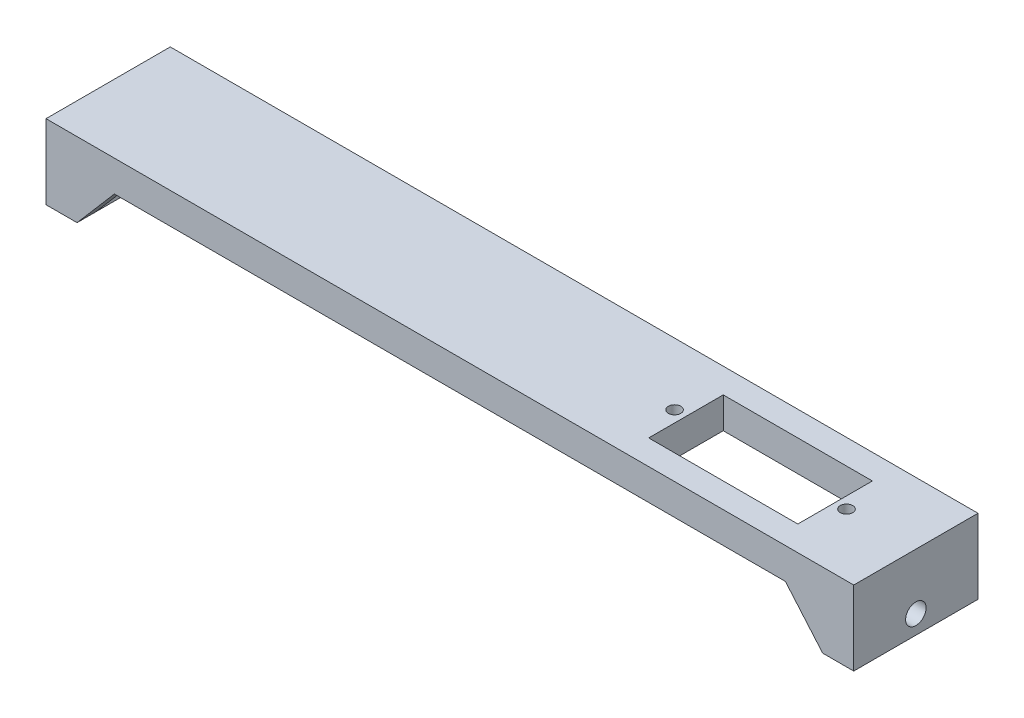
ISO-10303-21;
HEADER;
FILE_DESCRIPTION(('STEP AP214'),'2;1');
FILE_NAME('part.step','',(''),(''),'','','');
FILE_SCHEMA(('AUTOMOTIVE_DESIGN { 1 0 10303 214 1 1 1 1 }'));
ENDSEC;
DATA;
#1=APPLICATION_CONTEXT('core data for automotive mechanical design processes');
#2=APPLICATION_PROTOCOL_DEFINITION('international standard','automotive_design',2000,#1);
#3=PRODUCT_CONTEXT('',#1,'mechanical');
#4=PRODUCT('Part','Part','',(#3));
#5=PRODUCT_RELATED_PRODUCT_CATEGORY('part','',(#4));
#6=PRODUCT_DEFINITION_FORMATION('','',#4);
#7=PRODUCT_DEFINITION_CONTEXT('part definition',#1,'design');
#8=PRODUCT_DEFINITION('design','',#6,#7);
#9=PRODUCT_DEFINITION_SHAPE('','',#8);
#10=(LENGTH_UNIT() NAMED_UNIT(*) SI_UNIT(.MILLI.,.METRE.));
#11=(NAMED_UNIT(*) PLANE_ANGLE_UNIT() SI_UNIT($,.RADIAN.));
#12=(NAMED_UNIT(*) SI_UNIT($,.STERADIAN.) SOLID_ANGLE_UNIT());
#13=UNCERTAINTY_MEASURE_WITH_UNIT(LENGTH_MEASURE(1.E-05),#10,'distance_accuracy_value','');
#14=(GEOMETRIC_REPRESENTATION_CONTEXT(3) GLOBAL_UNCERTAINTY_ASSIGNED_CONTEXT((#13)) GLOBAL_UNIT_ASSIGNED_CONTEXT((#10,
#11,#12)) REPRESENTATION_CONTEXT('',''));
#15=CARTESIAN_POINT('',(0.,0.,0.));
#16=DIRECTION('',(0.,0.,1.));
#17=DIRECTION('',(1.,0.,0.));
#18=AXIS2_PLACEMENT_3D('',#15,#16,#17);
#19=CARTESIAN_POINT('',(60.,-5.00000000000001,20.));
#20=DIRECTION('',(0.,1.,0.));
#21=DIRECTION('',(0.,0.,1.));
#22=AXIS2_PLACEMENT_3D('',#19,#20,#21);
#23=PLANE('',#22);
#24=CARTESIAN_POINT('',(53.835,-5.00000000000001,10.));
#25=DIRECTION('',(0.,-1.,0.));
#26=DIRECTION('',(0.,0.,-1.));
#27=AXIS2_PLACEMENT_3D('',#24,#25,#26);
#28=CIRCLE('',#27,0.999999999999998);
#29=CARTESIAN_POINT('',(53.835,-5.00000000000001,9.));
#30=VERTEX_POINT('',#29);
#31=EDGE_CURVE('E618',#30,#30,#28,.T.);
#32=ORIENTED_EDGE('',*,*,#31,.F.);
#33=EDGE_LOOP('',(#32));
#34=FACE_BOUND('',#33,.T.);
#35=CARTESIAN_POINT('',(26.165,-5.00000000000001,10.));
#36=DIRECTION('',(0.,-1.,0.));
#37=DIRECTION('',(0.,0.,-1.));
#38=AXIS2_PLACEMENT_3D('',#35,#36,#37);
#39=CIRCLE('',#38,1.);
#40=CARTESIAN_POINT('',(26.165,-5.00000000000001,8.99999999999999));
#41=VERTEX_POINT('',#40);
#42=EDGE_CURVE('E186',#41,#41,#39,.T.);
#43=ORIENTED_EDGE('',*,*,#42,.F.);
#44=EDGE_LOOP('',(#43));
#45=FACE_BOUND('',#44,.T.);
#46=DIRECTION('',(-1.,0.,0.));
#47=VECTOR('',#46,1.);
#48=CARTESIAN_POINT('',(52.,-5.00000000000001,16.));
#49=LINE('',#48,#47);
#50=CARTESIAN_POINT('',(52.,-5.00000000000001,16.));
#51=VERTEX_POINT('',#50);
#52=CARTESIAN_POINT('',(28.,-5.00000000000001,16.));
#53=VERTEX_POINT('',#52);
#54=EDGE_CURVE('E192',#51,#53,#49,.T.);
#55=ORIENTED_EDGE('',*,*,#54,.F.);
#56=DIRECTION('',(0.,0.,1.));
#57=VECTOR('',#56,1.);
#58=CARTESIAN_POINT('',(52.,-5.00000000000001,4.));
#59=LINE('',#58,#57);
#60=CARTESIAN_POINT('',(52.,-5.00000000000001,4.));
#61=VERTEX_POINT('',#60);
#62=EDGE_CURVE('E54',#61,#51,#59,.T.);
#63=ORIENTED_EDGE('',*,*,#62,.F.);
#64=DIRECTION('',(-1.,0.,0.));
#65=VECTOR('',#64,1.);
#66=CARTESIAN_POINT('',(52.,-5.00000000000001,4.));
#67=LINE('',#66,#65);
#68=CARTESIAN_POINT('',(28.,-5.00000000000001,4.));
#69=VERTEX_POINT('',#68);
#70=EDGE_CURVE('E180',#61,#69,#67,.T.);
#71=ORIENTED_EDGE('',*,*,#70,.T.);
#72=DIRECTION('',(0.,0.,1.));
#73=VECTOR('',#72,1.);
#74=CARTESIAN_POINT('',(28.,-5.00000000000001,4.));
#75=LINE('',#74,#73);
#76=EDGE_CURVE('E183',#69,#53,#75,.T.);
#77=ORIENTED_EDGE('',*,*,#76,.T.);
#78=EDGE_LOOP('',(#55,#63,#71,#77));
#79=FACE_BOUND('',#78,.T.);
#80=DIRECTION('',(-1.,0.,0.));
#81=VECTOR('',#80,1.);
#82=CARTESIAN_POINT('',(54.,-5.00000000000001,17.));
#83=LINE('',#82,#81);
#84=CARTESIAN_POINT('',(60.,-5.00000000000001,17.));
#85=VERTEX_POINT('',#84);
#86=CARTESIAN_POINT('',(54.,-5.00000000000001,17.));
#87=VERTEX_POINT('',#86);
#88=EDGE_CURVE('E203',#85,#87,#83,.T.);
#89=ORIENTED_EDGE('',*,*,#88,.T.);
#90=DIRECTION('',(0.,0.,1.));
#91=VECTOR('',#90,1.);
#92=CARTESIAN_POINT('',(54.,-5.00000000000001,17.));
#93=LINE('',#92,#91);
#94=CARTESIAN_POINT('',(54.,-5.00000000000001,20.));
#95=VERTEX_POINT('',#94);
#96=EDGE_CURVE('E211',#87,#95,#93,.T.);
#97=ORIENTED_EDGE('',*,*,#96,.T.);
#98=DIRECTION('',(1.,0.,0.));
#99=VECTOR('',#98,1.);
#100=CARTESIAN_POINT('',(60.,-5.00000000000001,20.));
#101=LINE('',#100,#99);
#102=CARTESIAN_POINT('',(-54.,-5.00000000000001,20.));
#103=VERTEX_POINT('',#102);
#104=EDGE_CURVE('E281',#103,#95,#101,.T.);
#105=ORIENTED_EDGE('',*,*,#104,.F.);
#106=DIRECTION('',(0.,0.,1.));
#107=VECTOR('',#106,1.);
#108=CARTESIAN_POINT('',(-54.,-5.00000000000001,17.));
#109=LINE('',#108,#107);
#110=CARTESIAN_POINT('',(-54.,-5.00000000000001,17.));
#111=VERTEX_POINT('',#110);
#112=EDGE_CURVE('E241',#111,#103,#109,.T.);
#113=ORIENTED_EDGE('',*,*,#112,.F.);
#114=DIRECTION('',(1.,0.,0.));
#115=VECTOR('',#114,1.);
#116=CARTESIAN_POINT('',(-54.,-5.00000000000001,17.));
#117=LINE('',#116,#115);
#118=CARTESIAN_POINT('',(-60.,-5.00000000000001,17.));
#119=VERTEX_POINT('',#118);
#120=EDGE_CURVE('E234',#119,#111,#117,.T.);
#121=ORIENTED_EDGE('',*,*,#120,.F.);
#122=DIRECTION('',(0.,0.,-1.));
#123=VECTOR('',#122,1.);
#124=CARTESIAN_POINT('',(-60.,-5.00000000000001,20.));
#125=LINE('',#124,#123);
#126=CARTESIAN_POINT('',(-60.,-5.00000000000001,3.));
#127=VERTEX_POINT('',#126);
#128=EDGE_CURVE('E316',#119,#127,#125,.T.);
#129=ORIENTED_EDGE('',*,*,#128,.T.);
#130=DIRECTION('',(1.,0.,0.));
#131=VECTOR('',#130,1.);
#132=CARTESIAN_POINT('',(-54.,-5.00000000000001,3.));
#133=LINE('',#132,#131);
#134=CARTESIAN_POINT('',(-54.,-5.00000000000001,3.));
#135=VERTEX_POINT('',#134);
#136=EDGE_CURVE('E246',#127,#135,#133,.T.);
#137=ORIENTED_EDGE('',*,*,#136,.T.);
#138=DIRECTION('',(0.,0.,-1.));
#139=VECTOR('',#138,1.);
#140=CARTESIAN_POINT('',(-54.,-5.00000000000001,3.));
#141=LINE('',#140,#139);
#142=CARTESIAN_POINT('',(-54.,-5.,0.));
#143=VERTEX_POINT('',#142);
#144=EDGE_CURVE('E254',#135,#143,#141,.T.);
#145=ORIENTED_EDGE('',*,*,#144,.T.);
#146=DIRECTION('',(1.,0.,0.));
#147=VECTOR('',#146,1.);
#148=CARTESIAN_POINT('',(60.,-5.00000000000001,0.));
#149=LINE('',#148,#147);
#150=CARTESIAN_POINT('',(54.,-5.00000000000002,0.));
#151=VERTEX_POINT('',#150);
#152=EDGE_CURVE('E295',#143,#151,#149,.T.);
#153=ORIENTED_EDGE('',*,*,#152,.T.);
#154=DIRECTION('',(0.,0.,-1.));
#155=VECTOR('',#154,1.);
#156=CARTESIAN_POINT('',(54.,-5.00000000000001,3.));
#157=LINE('',#156,#155);
#158=CARTESIAN_POINT('',(54.,-5.00000000000001,3.));
#159=VERTEX_POINT('',#158);
#160=EDGE_CURVE('E228',#159,#151,#157,.T.);
#161=ORIENTED_EDGE('',*,*,#160,.F.);
#162=DIRECTION('',(-1.,0.,0.));
#163=VECTOR('',#162,1.);
#164=CARTESIAN_POINT('',(54.,-5.00000000000001,3.));
#165=LINE('',#164,#163);
#166=CARTESIAN_POINT('',(60.,-5.00000000000001,3.));
#167=VERTEX_POINT('',#166);
#168=EDGE_CURVE('E216',#167,#159,#165,.T.);
#169=ORIENTED_EDGE('',*,*,#168,.F.);
#170=DIRECTION('',(0.,0.,-1.));
#171=VECTOR('',#170,1.);
#172=CARTESIAN_POINT('',(60.,-5.00000000000001,20.));
#173=LINE('',#172,#171);
#174=EDGE_CURVE('E314',#85,#167,#173,.T.);
#175=ORIENTED_EDGE('',*,*,#174,.F.);
#176=EDGE_LOOP('',(#89,#97,#105,#113,#121,#129,#137,#145,#153,#161,#169,#175));
#177=FACE_BOUND('',#176,.T.);
#178=ADVANCED_FACE('F39',(#34,#45,#79,#177),#23,.F.);
#179=CARTESIAN_POINT('',(-65.,-12.,20.));
#180=DIRECTION('',(1.,0.,0.));
#181=DIRECTION('',(0.,0.,-1.));
#182=AXIS2_PLACEMENT_3D('',#179,#180,#181);
#183=PLANE('',#182);
#184=CARTESIAN_POINT('',(-65.,-8.99999999999999,10.));
#185=DIRECTION('',(1.,0.,0.));
#186=DIRECTION('',(0.,1.,0.));
#187=AXIS2_PLACEMENT_3D('',#184,#185,#186);
#188=CIRCLE('',#187,1.65);
#189=CARTESIAN_POINT('',(-65.,-7.34999999999999,10.));
#190=VERTEX_POINT('',#189);
#191=EDGE_CURVE('E264',#190,#190,#188,.T.);
#192=ORIENTED_EDGE('',*,*,#191,.T.);
#193=EDGE_LOOP('',(#192));
#194=FACE_BOUND('',#193,.T.);
#195=DIRECTION('',(0.,-1.,0.));
#196=VECTOR('',#195,1.);
#197=CARTESIAN_POINT('',(-65.,-12.,0.));
#198=LINE('',#197,#196);
#199=CARTESIAN_POINT('',(-65.,0.,0.));
#200=VERTEX_POINT('',#199);
#201=CARTESIAN_POINT('',(-65.,-12.,0.));
#202=VERTEX_POINT('',#201);
#203=EDGE_CURVE('E273',#200,#202,#198,.T.);
#204=ORIENTED_EDGE('',*,*,#203,.T.);
#205=DIRECTION('',(0.,0.,-1.));
#206=VECTOR('',#205,1.);
#207=CARTESIAN_POINT('',(-65.,-12.,20.));
#208=LINE('',#207,#206);
#209=CARTESIAN_POINT('',(-65.,-12.,20.));
#210=VERTEX_POINT('',#209);
#211=EDGE_CURVE('E11',#210,#202,#208,.T.);
#212=ORIENTED_EDGE('',*,*,#211,.F.);
#213=DIRECTION('',(0.,-1.,0.));
#214=VECTOR('',#213,1.);
#215=CARTESIAN_POINT('',(-65.,-12.,20.));
#216=LINE('',#215,#214);
#217=CARTESIAN_POINT('',(-65.,0.,20.));
#218=VERTEX_POINT('',#217);
#219=EDGE_CURVE('E274',#218,#210,#216,.T.);
#220=ORIENTED_EDGE('',*,*,#219,.F.);
#221=DIRECTION('',(0.,0.,-1.));
#222=VECTOR('',#221,1.);
#223=CARTESIAN_POINT('',(-65.,0.,20.));
#224=LINE('',#223,#222);
#225=EDGE_CURVE('E290',#218,#200,#224,.T.);
#226=ORIENTED_EDGE('',*,*,#225,.T.);
#227=EDGE_LOOP('',(#204,#212,#220,#226));
#228=FACE_BOUND('',#227,.T.);
#229=ADVANCED_FACE('F41',(#194,#228),#183,.F.);
#230=CARTESIAN_POINT('',(-60.,-12.,20.));
#231=DIRECTION('',(0.,1.,0.));
#232=DIRECTION('',(-1.,0.,0.));
#233=AXIS2_PLACEMENT_3D('',#230,#231,#232);
#234=PLANE('',#233);
#235=DIRECTION('',(1.,0.,0.));
#236=VECTOR('',#235,1.);
#237=CARTESIAN_POINT('',(-60.,-12.,0.));
#238=LINE('',#237,#236);
#239=CARTESIAN_POINT('',(-60.,-12.,0.));
#240=VERTEX_POINT('',#239);
#241=EDGE_CURVE('E293',#202,#240,#238,.T.);
#242=ORIENTED_EDGE('',*,*,#241,.T.);
#243=DIRECTION('',(0.,0.,-1.));
#244=VECTOR('',#243,1.);
#245=CARTESIAN_POINT('',(-60.,-12.,3.));
#246=LINE('',#245,#244);
#247=CARTESIAN_POINT('',(-60.,-12.,3.));
#248=VERTEX_POINT('',#247);
#249=EDGE_CURVE('E257',#248,#240,#246,.T.);
#250=ORIENTED_EDGE('',*,*,#249,.F.);
#251=DIRECTION('',(0.,0.,-1.));
#252=VECTOR('',#251,1.);
#253=CARTESIAN_POINT('',(-60.,-12.,20.));
#254=LINE('',#253,#252);
#255=CARTESIAN_POINT('',(-60.,-12.,17.));
#256=VERTEX_POINT('',#255);
#257=EDGE_CURVE('E317',#256,#248,#254,.T.);
#258=ORIENTED_EDGE('',*,*,#257,.F.);
#259=CARTESIAN_POINT('',(-60.,-12.,20.));
#260=VERTEX_POINT('',#259);
#261=EDGE_CURVE('E47',#260,#256,#254,.T.);
#262=ORIENTED_EDGE('',*,*,#261,.F.);
#263=DIRECTION('',(1.,0.,0.));
#264=VECTOR('',#263,1.);
#265=CARTESIAN_POINT('',(-60.,-12.,20.));
#266=LINE('',#265,#264);
#267=EDGE_CURVE('E277',#210,#260,#266,.T.);
#268=ORIENTED_EDGE('',*,*,#267,.F.);
#269=ORIENTED_EDGE('',*,*,#211,.T.);
#270=EDGE_LOOP('',(#242,#250,#258,#262,#268,#269));
#271=FACE_BOUND('',#270,.T.);
#272=ADVANCED_FACE('F330',(#271),#234,.F.);
#273=CARTESIAN_POINT('',(-60.,-5.00000000000001,20.));
#274=DIRECTION('',(-1.,0.,0.));
#275=DIRECTION('',(0.,-1.,0.));
#276=AXIS2_PLACEMENT_3D('',#273,#274,#275);
#277=PLANE('',#276);
#278=CARTESIAN_POINT('',(-60.,-9.,10.));
#279=DIRECTION('',(-1.,0.,0.));
#280=DIRECTION('',(0.,-1.,0.));
#281=AXIS2_PLACEMENT_3D('',#278,#279,#280);
#282=CIRCLE('',#281,1.65);
#283=CARTESIAN_POINT('',(-60.,-10.65,10.));
#284=VERTEX_POINT('',#283);
#285=EDGE_CURVE('E270',#284,#284,#282,.T.);
#286=ORIENTED_EDGE('',*,*,#285,.T.);
#287=EDGE_LOOP('',(#286));
#288=FACE_BOUND('',#287,.T.);
#289=ORIENTED_EDGE('',*,*,#128,.F.);
#290=DIRECTION('',(0.,1.,0.));
#291=VECTOR('',#290,1.);
#292=CARTESIAN_POINT('',(-60.,-5.00000000000001,17.));
#293=LINE('',#292,#291);
#294=EDGE_CURVE('E237',#256,#119,#293,.T.);
#295=ORIENTED_EDGE('',*,*,#294,.F.);
#296=ORIENTED_EDGE('',*,*,#257,.T.);
#297=DIRECTION('',(0.,1.,0.));
#298=VECTOR('',#297,1.);
#299=CARTESIAN_POINT('',(-60.,-5.00000000000001,3.));
#300=LINE('',#299,#298);
#301=EDGE_CURVE('E251',#248,#127,#300,.T.);
#302=ORIENTED_EDGE('',*,*,#301,.T.);
#303=EDGE_LOOP('',(#289,#295,#296,#302));
#304=FACE_BOUND('',#303,.T.);
#305=ADVANCED_FACE('F326',(#288,#304),#277,.F.);
#306=CARTESIAN_POINT('',(60.,-12.,20.));
#307=DIRECTION('',(1.,0.,0.));
#308=DIRECTION('',(0.,1.,0.));
#309=AXIS2_PLACEMENT_3D('',#306,#307,#308);
#310=PLANE('',#309);
#311=CARTESIAN_POINT('',(60.,-9.00000000000007,10.));
#312=DIRECTION('',(1.,0.,0.));
#313=DIRECTION('',(0.,1.,0.));
#314=AXIS2_PLACEMENT_3D('',#311,#312,#313);
#315=CIRCLE('',#314,1.65);
#316=CARTESIAN_POINT('',(60.,-7.35000000000007,10.));
#317=VERTEX_POINT('',#316);
#318=EDGE_CURVE('E267',#317,#317,#315,.T.);
#319=ORIENTED_EDGE('',*,*,#318,.T.);
#320=EDGE_LOOP('',(#319));
#321=FACE_BOUND('',#320,.T.);
#322=DIRECTION('',(0.,0.,-1.));
#323=VECTOR('',#322,1.);
#324=CARTESIAN_POINT('',(60.,-12.,20.));
#325=LINE('',#324,#323);
#326=CARTESIAN_POINT('',(60.,-12.,17.));
#327=VERTEX_POINT('',#326);
#328=CARTESIAN_POINT('',(60.,-12.,3.));
#329=VERTEX_POINT('',#328);
#330=EDGE_CURVE('E310',#327,#329,#325,.T.);
#331=ORIENTED_EDGE('',*,*,#330,.F.);
#332=DIRECTION('',(0.,1.,0.));
#333=VECTOR('',#332,1.);
#334=CARTESIAN_POINT('',(60.,-5.00000000000001,17.));
#335=LINE('',#334,#333);
#336=EDGE_CURVE('E208',#327,#85,#335,.T.);
#337=ORIENTED_EDGE('',*,*,#336,.T.);
#338=ORIENTED_EDGE('',*,*,#174,.T.);
#339=DIRECTION('',(0.,1.,0.));
#340=VECTOR('',#339,1.);
#341=CARTESIAN_POINT('',(60.,-5.00000000000001,3.));
#342=LINE('',#341,#340);
#343=EDGE_CURVE('E219',#329,#167,#342,.T.);
#344=ORIENTED_EDGE('',*,*,#343,.F.);
#345=EDGE_LOOP('',(#331,#337,#338,#344));
#346=FACE_BOUND('',#345,.T.);
#347=ADVANCED_FACE('F370',(#321,#346),#310,.F.);
#348=CARTESIAN_POINT('',(65.,-12.,20.));
#349=DIRECTION('',(0.,1.,0.));
#350=DIRECTION('',(0.,0.,1.));
#351=AXIS2_PLACEMENT_3D('',#348,#349,#350);
#352=PLANE('',#351);
#353=DIRECTION('',(1.,0.,0.));
#354=VECTOR('',#353,1.);
#355=CARTESIAN_POINT('',(65.,-12.,0.));
#356=LINE('',#355,#354);
#357=CARTESIAN_POINT('',(60.,-12.,0.));
#358=VERTEX_POINT('',#357);
#359=CARTESIAN_POINT('',(65.,-12.,0.));
#360=VERTEX_POINT('',#359);
#361=EDGE_CURVE('E297',#358,#360,#356,.T.);
#362=ORIENTED_EDGE('',*,*,#361,.T.);
#363=DIRECTION('',(0.,0.,-1.));
#364=VECTOR('',#363,1.);
#365=CARTESIAN_POINT('',(65.,-12.,20.));
#366=LINE('',#365,#364);
#367=CARTESIAN_POINT('',(65.,-12.,20.));
#368=VERTEX_POINT('',#367);
#369=EDGE_CURVE('E307',#368,#360,#366,.T.);
#370=ORIENTED_EDGE('',*,*,#369,.F.);
#371=DIRECTION('',(1.,0.,0.));
#372=VECTOR('',#371,1.);
#373=CARTESIAN_POINT('',(65.,-12.,20.));
#374=LINE('',#373,#372);
#375=CARTESIAN_POINT('',(60.,-12.,20.));
#376=VERTEX_POINT('',#375);
#377=EDGE_CURVE('E284',#376,#368,#374,.T.);
#378=ORIENTED_EDGE('',*,*,#377,.F.);
#379=EDGE_CURVE('E311',#376,#327,#325,.T.);
#380=ORIENTED_EDGE('',*,*,#379,.T.);
#381=ORIENTED_EDGE('',*,*,#330,.T.);
#382=DIRECTION('',(0.,0.,-1.));
#383=VECTOR('',#382,1.);
#384=CARTESIAN_POINT('',(60.,-12.,3.));
#385=LINE('',#384,#383);
#386=EDGE_CURVE('E225',#329,#358,#385,.T.);
#387=ORIENTED_EDGE('',*,*,#386,.T.);
#388=EDGE_LOOP('',(#362,#370,#378,#380,#381,#387));
#389=FACE_BOUND('',#388,.T.);
#390=ADVANCED_FACE('F380',(#389),#352,.F.);
#391=CARTESIAN_POINT('',(65.,0.,20.));
#392=DIRECTION('',(-1.,0.,0.));
#393=DIRECTION('',(0.,0.,1.));
#394=AXIS2_PLACEMENT_3D('',#391,#392,#393);
#395=PLANE('',#394);
#396=CARTESIAN_POINT('',(65.,-9.00000000000007,10.));
#397=DIRECTION('',(1.,0.,0.));
#398=DIRECTION('',(0.,1.,0.));
#399=AXIS2_PLACEMENT_3D('',#396,#397,#398);
#400=CIRCLE('',#399,1.65);
#401=CARTESIAN_POINT('',(65.,-7.35000000000007,10.));
#402=VERTEX_POINT('',#401);
#403=EDGE_CURVE('E260',#402,#402,#400,.T.);
#404=ORIENTED_EDGE('',*,*,#403,.F.);
#405=EDGE_LOOP('',(#404));
#406=FACE_BOUND('',#405,.T.);
#407=DIRECTION('',(0.,1.,0.));
#408=VECTOR('',#407,1.);
#409=CARTESIAN_POINT('',(65.,0.,0.));
#410=LINE('',#409,#408);
#411=CARTESIAN_POINT('',(65.,0.,0.));
#412=VERTEX_POINT('',#411);
#413=EDGE_CURVE('E299',#360,#412,#410,.T.);
#414=ORIENTED_EDGE('',*,*,#413,.T.);
#415=DIRECTION('',(0.,0.,-1.));
#416=VECTOR('',#415,1.);
#417=CARTESIAN_POINT('',(65.,0.,20.));
#418=LINE('',#417,#416);
#419=CARTESIAN_POINT('',(65.,0.,20.));
#420=VERTEX_POINT('',#419);
#421=EDGE_CURVE('E304',#420,#412,#418,.T.);
#422=ORIENTED_EDGE('',*,*,#421,.F.);
#423=DIRECTION('',(0.,1.,0.));
#424=VECTOR('',#423,1.);
#425=CARTESIAN_POINT('',(65.,0.,20.));
#426=LINE('',#425,#424);
#427=EDGE_CURVE('E286',#368,#420,#426,.T.);
#428=ORIENTED_EDGE('',*,*,#427,.F.);
#429=ORIENTED_EDGE('',*,*,#369,.T.);
#430=EDGE_LOOP('',(#414,#422,#428,#429));
#431=FACE_BOUND('',#430,.T.);
#432=ADVANCED_FACE('F385',(#406,#431),#395,.F.);
#433=CARTESIAN_POINT('',(-65.,0.,20.));
#434=DIRECTION('',(0.,-1.,0.));
#435=DIRECTION('',(0.,0.,-1.));
#436=AXIS2_PLACEMENT_3D('',#433,#434,#435);
#437=PLANE('',#436);
#438=CARTESIAN_POINT('',(53.835,0.,10.));
#439=DIRECTION('',(0.,-1.,0.));
#440=DIRECTION('',(0.,0.,-1.));
#441=AXIS2_PLACEMENT_3D('',#438,#439,#440);
#442=CIRCLE('',#441,0.999999999999998);
#443=CARTESIAN_POINT('',(53.835,0.,9.));
#444=VERTEX_POINT('',#443);
#445=EDGE_CURVE('E193',#444,#444,#442,.T.);
#446=ORIENTED_EDGE('',*,*,#445,.T.);
#447=EDGE_LOOP('',(#446));
#448=FACE_BOUND('',#447,.T.);
#449=CARTESIAN_POINT('',(26.165,0.,10.));
#450=DIRECTION('',(0.,-1.,0.));
#451=DIRECTION('',(0.,0.,-1.));
#452=AXIS2_PLACEMENT_3D('',#449,#450,#451);
#453=CIRCLE('',#452,1.);
#454=CARTESIAN_POINT('',(26.165,0.,8.99999999999999));
#455=VERTEX_POINT('',#454);
#456=EDGE_CURVE('E619',#455,#455,#453,.T.);
#457=ORIENTED_EDGE('',*,*,#456,.T.);
#458=EDGE_LOOP('',(#457));
#459=FACE_BOUND('',#458,.T.);
#460=DIRECTION('',(-1.,0.,0.));
#461=VECTOR('',#460,1.);
#462=CARTESIAN_POINT('',(52.,0.,4.));
#463=LINE('',#462,#461);
#464=CARTESIAN_POINT('',(52.,0.,4.));
#465=VERTEX_POINT('',#464);
#466=CARTESIAN_POINT('',(28.,0.,4.));
#467=VERTEX_POINT('',#466);
#468=EDGE_CURVE('E169',#465,#467,#463,.T.);
#469=ORIENTED_EDGE('',*,*,#468,.F.);
#470=DIRECTION('',(0.,0.,1.));
#471=VECTOR('',#470,1.);
#472=CARTESIAN_POINT('',(52.,0.,4.));
#473=LINE('',#472,#471);
#474=CARTESIAN_POINT('',(52.,0.,16.));
#475=VERTEX_POINT('',#474);
#476=EDGE_CURVE('E166',#465,#475,#473,.T.);
#477=ORIENTED_EDGE('',*,*,#476,.T.);
#478=DIRECTION('',(-1.,0.,0.));
#479=VECTOR('',#478,1.);
#480=CARTESIAN_POINT('',(52.,0.,16.));
#481=LINE('',#480,#479);
#482=CARTESIAN_POINT('',(28.,0.,16.));
#483=VERTEX_POINT('',#482);
#484=EDGE_CURVE('E172',#475,#483,#481,.T.);
#485=ORIENTED_EDGE('',*,*,#484,.T.);
#486=DIRECTION('',(0.,0.,1.));
#487=VECTOR('',#486,1.);
#488=CARTESIAN_POINT('',(28.,0.,4.));
#489=LINE('',#488,#487);
#490=EDGE_CURVE('E176',#467,#483,#489,.T.);
#491=ORIENTED_EDGE('',*,*,#490,.F.);
#492=EDGE_LOOP('',(#469,#477,#485,#491));
#493=FACE_BOUND('',#492,.T.);
#494=DIRECTION('',(-1.,0.,0.));
#495=VECTOR('',#494,1.);
#496=CARTESIAN_POINT('',(-65.,0.,0.));
#497=LINE('',#496,#495);
#498=EDGE_CURVE('E278',#412,#200,#497,.T.);
#499=ORIENTED_EDGE('',*,*,#498,.T.);
#500=ORIENTED_EDGE('',*,*,#225,.F.);
#501=DIRECTION('',(-1.,0.,0.));
#502=VECTOR('',#501,1.);
#503=CARTESIAN_POINT('',(-65.,0.,20.));
#504=LINE('',#503,#502);
#505=EDGE_CURVE('E288',#420,#218,#504,.T.);
#506=ORIENTED_EDGE('',*,*,#505,.F.);
#507=ORIENTED_EDGE('',*,*,#421,.T.);
#508=EDGE_LOOP('',(#499,#500,#506,#507));
#509=FACE_BOUND('',#508,.T.);
#510=ADVANCED_FACE('F178',(#448,#459,#493,#509),#437,.F.);
#511=CARTESIAN_POINT('',(0.,0.,20.));
#512=DIRECTION('',(0.,0.,-1.));
#513=DIRECTION('',(-1.,0.,0.));
#514=AXIS2_PLACEMENT_3D('',#511,#512,#513);
#515=PLANE('',#514);
#516=ORIENTED_EDGE('',*,*,#104,.T.);
#517=DIRECTION('',(0.65079137345597,-0.759256602365296,0.));
#518=VECTOR('',#517,1.);
#519=CARTESIAN_POINT('',(54.,-5.00000000000001,20.));
#520=LINE('',#519,#518);
#521=EDGE_CURVE('E199',#95,#376,#520,.T.);
#522=ORIENTED_EDGE('',*,*,#521,.T.);
#523=ORIENTED_EDGE('',*,*,#377,.T.);
#524=ORIENTED_EDGE('',*,*,#427,.T.);
#525=ORIENTED_EDGE('',*,*,#505,.T.);
#526=ORIENTED_EDGE('',*,*,#219,.T.);
#527=ORIENTED_EDGE('',*,*,#267,.T.);
#528=DIRECTION('',(-0.65079137345597,-0.759256602365296,0.));
#529=VECTOR('',#528,1.);
#530=CARTESIAN_POINT('',(-54.,-5.00000000000001,20.));
#531=LINE('',#530,#529);
#532=EDGE_CURVE('E231',#103,#260,#531,.T.);
#533=ORIENTED_EDGE('',*,*,#532,.F.);
#534=EDGE_LOOP('',(#516,#522,#523,#524,#525,#526,#527,#533));
#535=FACE_BOUND('',#534,.T.);
#536=ADVANCED_FACE('F347',(#535),#515,.F.);
#537=CARTESIAN_POINT('',(0.,0.,0.));
#538=DIRECTION('',(0.,0.,-1.));
#539=DIRECTION('',(-1.,0.,0.));
#540=AXIS2_PLACEMENT_3D('',#537,#538,#539);
#541=PLANE('',#540);
#542=DIRECTION('',(0.65079137345597,-0.759256602365296,0.));
#543=VECTOR('',#542,1.);
#544=CARTESIAN_POINT('',(54.,-5.00000000000001,0.));
#545=LINE('',#544,#543);
#546=EDGE_CURVE('E215',#151,#358,#545,.T.);
#547=ORIENTED_EDGE('',*,*,#546,.F.);
#548=ORIENTED_EDGE('',*,*,#152,.F.);
#549=DIRECTION('',(-0.65079137345597,-0.759256602365296,0.));
#550=VECTOR('',#549,1.);
#551=CARTESIAN_POINT('',(-54.,-5.00000000000001,0.));
#552=LINE('',#551,#550);
#553=EDGE_CURVE('E245',#143,#240,#552,.T.);
#554=ORIENTED_EDGE('',*,*,#553,.T.);
#555=ORIENTED_EDGE('',*,*,#241,.F.);
#556=ORIENTED_EDGE('',*,*,#203,.F.);
#557=ORIENTED_EDGE('',*,*,#498,.F.);
#558=ORIENTED_EDGE('',*,*,#413,.F.);
#559=ORIENTED_EDGE('',*,*,#361,.F.);
#560=EDGE_LOOP('',(#547,#548,#554,#555,#556,#557,#558,#559));
#561=FACE_BOUND('',#560,.T.);
#562=ADVANCED_FACE('F357',(#561),#541,.T.);
#563=CARTESIAN_POINT('',(-65.,-8.99999999999999,10.));
#564=DIRECTION('',(1.,0.,0.));
#565=DIRECTION('',(0.,1.,0.));
#566=AXIS2_PLACEMENT_3D('',#563,#564,#565);
#567=CYLINDRICAL_SURFACE('',#566,1.65);
#568=ORIENTED_EDGE('',*,*,#403,.T.);
#569=EDGE_LOOP('',(#568));
#570=FACE_BOUND('',#569,.T.);
#571=ORIENTED_EDGE('',*,*,#318,.F.);
#572=EDGE_LOOP('',(#571));
#573=FACE_BOUND('',#572,.T.);
#574=ADVANCED_FACE('F449',(#570,#573),#567,.F.);
#575=ORIENTED_EDGE('',*,*,#191,.F.);
#576=EDGE_LOOP('',(#575));
#577=FACE_BOUND('',#576,.T.);
#578=ORIENTED_EDGE('',*,*,#285,.F.);
#579=EDGE_LOOP('',(#578));
#580=FACE_BOUND('',#579,.T.);
#581=ADVANCED_FACE('F454',(#577,#580),#567,.F.);
#582=CARTESIAN_POINT('',(-54.,-5.00000000000001,3.));
#583=DIRECTION('',(0.759256602365296,-0.650791373455969,0.));
#584=DIRECTION('',(0.65079137345597,0.759256602365296,0.));
#585=AXIS2_PLACEMENT_3D('',#582,#583,#584);
#586=PLANE('',#585);
#587=ORIENTED_EDGE('',*,*,#553,.F.);
#588=ORIENTED_EDGE('',*,*,#144,.F.);
#589=DIRECTION('',(-0.65079137345597,-0.759256602365296,0.));
#590=VECTOR('',#589,1.);
#591=CARTESIAN_POINT('',(-54.,-5.00000000000001,3.));
#592=LINE('',#591,#590);
#593=EDGE_CURVE('E248',#135,#248,#592,.T.);
#594=ORIENTED_EDGE('',*,*,#593,.T.);
#595=ORIENTED_EDGE('',*,*,#249,.T.);
#596=EDGE_LOOP('',(#587,#588,#594,#595));
#597=FACE_BOUND('',#596,.T.);
#598=ADVANCED_FACE('F335',(#597),#586,.T.);
#599=CARTESIAN_POINT('',(0.,0.,3.));
#600=DIRECTION('',(0.,0.,1.));
#601=DIRECTION('',(1.,0.,0.));
#602=AXIS2_PLACEMENT_3D('',#599,#600,#601);
#603=PLANE('',#602);
#604=ORIENTED_EDGE('',*,*,#136,.F.);
#605=ORIENTED_EDGE('',*,*,#301,.F.);
#606=ORIENTED_EDGE('',*,*,#593,.F.);
#607=EDGE_LOOP('',(#604,#605,#606));
#608=FACE_BOUND('',#607,.T.);
#609=ADVANCED_FACE('F337',(#608),#603,.T.);
#610=CARTESIAN_POINT('',(-54.,-5.00000000000001,17.));
#611=DIRECTION('',(-0.759256602365296,0.650791373455969,0.));
#612=DIRECTION('',(-0.65079137345597,-0.759256602365296,0.));
#613=AXIS2_PLACEMENT_3D('',#610,#611,#612);
#614=PLANE('',#613);
#615=ORIENTED_EDGE('',*,*,#532,.T.);
#616=ORIENTED_EDGE('',*,*,#261,.T.);
#617=DIRECTION('',(-0.65079137345597,-0.759256602365296,0.));
#618=VECTOR('',#617,1.);
#619=CARTESIAN_POINT('',(-54.,-5.00000000000001,17.));
#620=LINE('',#619,#618);
#621=EDGE_CURVE('E239',#111,#256,#620,.T.);
#622=ORIENTED_EDGE('',*,*,#621,.F.);
#623=ORIENTED_EDGE('',*,*,#112,.T.);
#624=EDGE_LOOP('',(#615,#616,#622,#623));
#625=FACE_BOUND('',#624,.T.);
#626=ADVANCED_FACE('F345',(#625),#614,.F.);
#627=CARTESIAN_POINT('',(0.,0.,17.));
#628=DIRECTION('',(0.,0.,-1.));
#629=DIRECTION('',(1.,0.,0.));
#630=AXIS2_PLACEMENT_3D('',#627,#628,#629);
#631=PLANE('',#630);
#632=ORIENTED_EDGE('',*,*,#120,.T.);
#633=ORIENTED_EDGE('',*,*,#621,.T.);
#634=ORIENTED_EDGE('',*,*,#294,.T.);
#635=EDGE_LOOP('',(#632,#633,#634));
#636=FACE_BOUND('',#635,.T.);
#637=ADVANCED_FACE('F344',(#636),#631,.T.);
#638=CARTESIAN_POINT('',(54.,-5.00000000000001,3.));
#639=DIRECTION('',(0.759256602365296,0.650791373455969,0.));
#640=DIRECTION('',(-0.65079137345597,0.759256602365296,0.));
#641=AXIS2_PLACEMENT_3D('',#638,#639,#640);
#642=PLANE('',#641);
#643=ORIENTED_EDGE('',*,*,#546,.T.);
#644=ORIENTED_EDGE('',*,*,#386,.F.);
#645=DIRECTION('',(0.65079137345597,-0.759256602365296,0.));
#646=VECTOR('',#645,1.);
#647=CARTESIAN_POINT('',(54.,-5.00000000000001,3.));
#648=LINE('',#647,#646);
#649=EDGE_CURVE('E222',#159,#329,#648,.T.);
#650=ORIENTED_EDGE('',*,*,#649,.F.);
#651=ORIENTED_EDGE('',*,*,#160,.T.);
#652=EDGE_LOOP('',(#643,#644,#650,#651));
#653=FACE_BOUND('',#652,.T.);
#654=ADVANCED_FACE('F364',(#653),#642,.F.);
#655=CARTESIAN_POINT('',(0.,0.,3.));
#656=DIRECTION('',(0.,0.,1.));
#657=DIRECTION('',(-1.,0.,0.));
#658=AXIS2_PLACEMENT_3D('',#655,#656,#657);
#659=PLANE('',#658);
#660=ORIENTED_EDGE('',*,*,#168,.T.);
#661=ORIENTED_EDGE('',*,*,#649,.T.);
#662=ORIENTED_EDGE('',*,*,#343,.T.);
#663=EDGE_LOOP('',(#660,#661,#662));
#664=FACE_BOUND('',#663,.T.);
#665=ADVANCED_FACE('F366',(#664),#659,.T.);
#666=CARTESIAN_POINT('',(54.,-5.00000000000001,17.));
#667=DIRECTION('',(-0.759256602365296,-0.650791373455969,0.));
#668=DIRECTION('',(0.65079137345597,-0.759256602365296,0.));
#669=AXIS2_PLACEMENT_3D('',#666,#667,#668);
#670=PLANE('',#669);
#671=ORIENTED_EDGE('',*,*,#521,.F.);
#672=ORIENTED_EDGE('',*,*,#96,.F.);
#673=DIRECTION('',(0.65079137345597,-0.759256602365296,0.));
#674=VECTOR('',#673,1.);
#675=CARTESIAN_POINT('',(54.,-5.00000000000001,17.));
#676=LINE('',#675,#674);
#677=EDGE_CURVE('E206',#87,#327,#676,.T.);
#678=ORIENTED_EDGE('',*,*,#677,.T.);
#679=ORIENTED_EDGE('',*,*,#379,.F.);
#680=EDGE_LOOP('',(#671,#672,#678,#679));
#681=FACE_BOUND('',#680,.T.);
#682=ADVANCED_FACE('F376',(#681),#670,.T.);
#683=CARTESIAN_POINT('',(0.,0.,17.));
#684=DIRECTION('',(0.,0.,-1.));
#685=DIRECTION('',(-1.,0.,0.));
#686=AXIS2_PLACEMENT_3D('',#683,#684,#685);
#687=PLANE('',#686);
#688=ORIENTED_EDGE('',*,*,#88,.F.);
#689=ORIENTED_EDGE('',*,*,#336,.F.);
#690=ORIENTED_EDGE('',*,*,#677,.F.);
#691=EDGE_LOOP('',(#688,#689,#690));
#692=FACE_BOUND('',#691,.T.);
#693=ADVANCED_FACE('F374',(#692),#687,.T.);
#694=CARTESIAN_POINT('',(52.,0.,4.));
#695=DIRECTION('',(1.,0.,0.));
#696=DIRECTION('',(0.,0.,-1.));
#697=AXIS2_PLACEMENT_3D('',#694,#695,#696);
#698=PLANE('',#697);
#699=ORIENTED_EDGE('',*,*,#62,.T.);
#700=DIRECTION('',(0.,-1.,0.));
#701=VECTOR('',#700,1.);
#702=CARTESIAN_POINT('',(52.,0.,16.));
#703=LINE('',#702,#701);
#704=EDGE_CURVE('E163',#475,#51,#703,.T.);
#705=ORIENTED_EDGE('',*,*,#704,.F.);
#706=ORIENTED_EDGE('',*,*,#476,.F.);
#707=DIRECTION('',(0.,-1.,0.));
#708=VECTOR('',#707,1.);
#709=CARTESIAN_POINT('',(52.,0.,4.));
#710=LINE('',#709,#708);
#711=EDGE_CURVE('E197',#465,#61,#710,.T.);
#712=ORIENTED_EDGE('',*,*,#711,.T.);
#713=EDGE_LOOP('',(#699,#705,#706,#712));
#714=FACE_BOUND('',#713,.T.);
#715=ADVANCED_FACE('F164',(#714),#698,.F.);
#716=CARTESIAN_POINT('',(52.,0.,4.));
#717=DIRECTION('',(0.,0.,1.));
#718=DIRECTION('',(1.,0.,0.));
#719=AXIS2_PLACEMENT_3D('',#716,#717,#718);
#720=PLANE('',#719);
#721=ORIENTED_EDGE('',*,*,#70,.F.);
#722=ORIENTED_EDGE('',*,*,#711,.F.);
#723=ORIENTED_EDGE('',*,*,#468,.T.);
#724=DIRECTION('',(0.,-1.,0.));
#725=VECTOR('',#724,1.);
#726=CARTESIAN_POINT('',(28.,0.,4.));
#727=LINE('',#726,#725);
#728=EDGE_CURVE('E200',#467,#69,#727,.T.);
#729=ORIENTED_EDGE('',*,*,#728,.T.);
#730=EDGE_LOOP('',(#721,#722,#723,#729));
#731=FACE_BOUND('',#730,.T.);
#732=ADVANCED_FACE('F525',(#731),#720,.T.);
#733=CARTESIAN_POINT('',(28.,0.,4.));
#734=DIRECTION('',(1.,0.,0.));
#735=DIRECTION('',(0.,0.,-1.));
#736=AXIS2_PLACEMENT_3D('',#733,#734,#735);
#737=PLANE('',#736);
#738=ORIENTED_EDGE('',*,*,#76,.F.);
#739=ORIENTED_EDGE('',*,*,#728,.F.);
#740=ORIENTED_EDGE('',*,*,#490,.T.);
#741=DIRECTION('',(0.,-1.,0.));
#742=VECTOR('',#741,1.);
#743=CARTESIAN_POINT('',(28.,0.,16.));
#744=LINE('',#743,#742);
#745=EDGE_CURVE('E62',#483,#53,#744,.T.);
#746=ORIENTED_EDGE('',*,*,#745,.T.);
#747=EDGE_LOOP('',(#738,#739,#740,#746));
#748=FACE_BOUND('',#747,.T.);
#749=ADVANCED_FACE('F532',(#748),#737,.T.);
#750=CARTESIAN_POINT('',(52.,0.,16.));
#751=DIRECTION('',(0.,0.,1.));
#752=DIRECTION('',(1.,0.,0.));
#753=AXIS2_PLACEMENT_3D('',#750,#751,#752);
#754=PLANE('',#753);
#755=ORIENTED_EDGE('',*,*,#54,.T.);
#756=ORIENTED_EDGE('',*,*,#745,.F.);
#757=ORIENTED_EDGE('',*,*,#484,.F.);
#758=ORIENTED_EDGE('',*,*,#704,.T.);
#759=EDGE_LOOP('',(#755,#756,#757,#758));
#760=FACE_BOUND('',#759,.T.);
#761=ADVANCED_FACE('F173',(#760),#754,.F.);
#762=CARTESIAN_POINT('',(26.165,0.,10.));
#763=DIRECTION('',(0.,-1.,0.));
#764=DIRECTION('',(0.,0.,-1.));
#765=AXIS2_PLACEMENT_3D('',#762,#763,#764);
#766=CYLINDRICAL_SURFACE('',#765,1.);
#767=ORIENTED_EDGE('',*,*,#456,.F.);
#768=EDGE_LOOP('',(#767));
#769=FACE_BOUND('',#768,.T.);
#770=ORIENTED_EDGE('',*,*,#42,.T.);
#771=EDGE_LOOP('',(#770));
#772=FACE_BOUND('',#771,.T.);
#773=ADVANCED_FACE('F547',(#769,#772),#766,.F.);
#774=CARTESIAN_POINT('',(53.835,0.,10.));
#775=DIRECTION('',(0.,-1.,0.));
#776=DIRECTION('',(0.,0.,-1.));
#777=AXIS2_PLACEMENT_3D('',#774,#775,#776);
#778=CYLINDRICAL_SURFACE('',#777,0.999999999999998);
#779=ORIENTED_EDGE('',*,*,#445,.F.);
#780=EDGE_LOOP('',(#779));
#781=FACE_BOUND('',#780,.T.);
#782=ORIENTED_EDGE('',*,*,#31,.T.);
#783=EDGE_LOOP('',(#782));
#784=FACE_BOUND('',#783,.T.);
#785=ADVANCED_FACE('F554',(#781,#784),#778,.F.);
#786=CLOSED_SHELL('',(#178,#229,#272,#305,#347,#390,#432,#510,#536,#562,#574,#581,#598,#609,
#626,#637,#654,#665,#682,#693,#715,#732,#749,#761,#773,#785));
#787=MANIFOLD_SOLID_BREP('B2',#786);
#788=ADVANCED_BREP_SHAPE_REPRESENTATION('',(#18,#787),#14);
#789=SHAPE_DEFINITION_REPRESENTATION(#9,#788);
ENDSEC;
END-ISO-10303-21;
